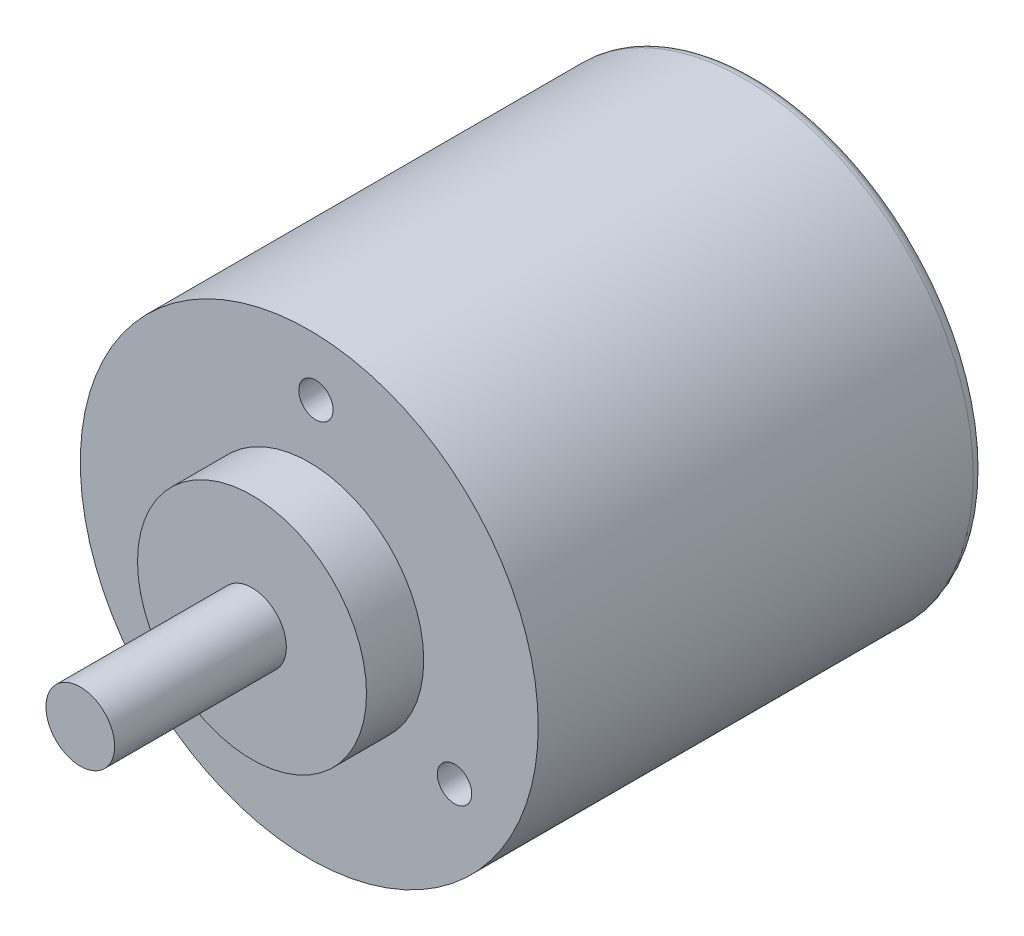
ISO-10303-21;
HEADER;
FILE_DESCRIPTION(('STEP AP214'),'2;1');
FILE_NAME('part.step','',(''),(''),'','','');
FILE_SCHEMA(('AUTOMOTIVE_DESIGN { 1 0 10303 214 1 1 1 1 }'));
ENDSEC;
DATA;
#1=APPLICATION_CONTEXT('core data for automotive mechanical design processes');
#2=APPLICATION_PROTOCOL_DEFINITION('international standard','automotive_design',2000,#1);
#3=PRODUCT_CONTEXT('',#1,'mechanical');
#4=PRODUCT('Part','Part','',(#3));
#5=PRODUCT_RELATED_PRODUCT_CATEGORY('part','',(#4));
#6=PRODUCT_DEFINITION_FORMATION('','',#4);
#7=PRODUCT_DEFINITION_CONTEXT('part definition',#1,'design');
#8=PRODUCT_DEFINITION('design','',#6,#7);
#9=PRODUCT_DEFINITION_SHAPE('','',#8);
#10=(LENGTH_UNIT() NAMED_UNIT(*) SI_UNIT(.MILLI.,.METRE.));
#11=(NAMED_UNIT(*) PLANE_ANGLE_UNIT() SI_UNIT($,.RADIAN.));
#12=(NAMED_UNIT(*) SI_UNIT($,.STERADIAN.) SOLID_ANGLE_UNIT());
#13=UNCERTAINTY_MEASURE_WITH_UNIT(LENGTH_MEASURE(1.E-05),#10,'distance_accuracy_value','');
#14=(GEOMETRIC_REPRESENTATION_CONTEXT(3) GLOBAL_UNCERTAINTY_ASSIGNED_CONTEXT((#13)) GLOBAL_UNIT_ASSIGNED_CONTEXT((#10,
#11,#12)) REPRESENTATION_CONTEXT('',''));
#15=CARTESIAN_POINT('',(0.,0.,0.));
#16=DIRECTION('',(0.,0.,1.));
#17=DIRECTION('',(1.,0.,0.));
#18=AXIS2_PLACEMENT_3D('',#15,#16,#17);
#19=CARTESIAN_POINT('',(0.,0.,39.));
#20=DIRECTION('',(0.,0.,-1.));
#21=DIRECTION('',(-1.,0.,0.));
#22=AXIS2_PLACEMENT_3D('',#19,#20,#21);
#23=CYLINDRICAL_SURFACE('',#22,20.);
#24=CARTESIAN_POINT('',(0.,0.,1.));
#25=DIRECTION('',(0.,0.,1.));
#26=DIRECTION('',(1.,0.,0.));
#27=AXIS2_PLACEMENT_3D('',#24,#25,#26);
#28=CIRCLE('',#27,20.);
#29=CARTESIAN_POINT('',(20.,0.,1.));
#30=VERTEX_POINT('',#29);
#31=EDGE_CURVE('E44',#30,#30,#28,.T.);
#32=ORIENTED_EDGE('',*,*,#31,.T.);
#33=EDGE_LOOP('',(#32));
#34=FACE_BOUND('',#33,.T.);
#35=CARTESIAN_POINT('',(0.,0.,39.));
#36=DIRECTION('',(0.,0.,1.));
#37=DIRECTION('',(1.,0.,0.));
#38=AXIS2_PLACEMENT_3D('',#35,#36,#37);
#39=CIRCLE('',#38,20.);
#40=CARTESIAN_POINT('',(20.,0.,39.));
#41=VERTEX_POINT('',#40);
#42=EDGE_CURVE('E57',#41,#41,#39,.T.);
#43=ORIENTED_EDGE('',*,*,#42,.F.);
#44=EDGE_LOOP('',(#43));
#45=FACE_BOUND('',#44,.T.);
#46=ADVANCED_FACE('F36',(#34,#45),#23,.T.);
#47=CARTESIAN_POINT('',(0.,0.,39.));
#48=DIRECTION('',(0.,0.,1.));
#49=DIRECTION('',(1.,0.,0.));
#50=AXIS2_PLACEMENT_3D('',#47,#48,#49);
#51=PLANE('',#50);
#52=CARTESIAN_POINT('',(-13.2709827552076,-6.99149602810312,39.));
#53=DIRECTION('',(0.,0.,1.));
#54=DIRECTION('',(-0.500000000000004,0.866025403784436,0.));
#55=AXIS2_PLACEMENT_3D('',#52,#53,#54);
#56=CIRCLE('',#55,1.5);
#57=CARTESIAN_POINT('',(-14.0209827552076,-5.69245792242647,39.));
#58=VERTEX_POINT('',#57);
#59=EDGE_CURVE('E89',#58,#58,#56,.T.);
#60=ORIENTED_EDGE('',*,*,#59,.F.);
#61=EDGE_LOOP('',(#60));
#62=FACE_BOUND('',#61,.T.);
#63=CARTESIAN_POINT('',(12.6903045483992,-7.99726018514339,39.));
#64=DIRECTION('',(0.,0.,1.));
#65=DIRECTION('',(-0.499999999999992,-0.866025403784443,0.));
#66=AXIS2_PLACEMENT_3D('',#63,#64,#65);
#67=CIRCLE('',#66,1.5);
#68=CARTESIAN_POINT('',(11.9403045483992,-9.29629829082005,39.));
#69=VERTEX_POINT('',#68);
#70=EDGE_CURVE('E81',#69,#69,#67,.T.);
#71=ORIENTED_EDGE('',*,*,#70,.F.);
#72=EDGE_LOOP('',(#71));
#73=FACE_BOUND('',#72,.T.);
#74=CARTESIAN_POINT('',(0.580678206808581,14.9887562132466,39.));
#75=DIRECTION('',(0.,0.,1.));
#76=DIRECTION('',(1.,0.,0.));
#77=AXIS2_PLACEMENT_3D('',#74,#75,#76);
#78=CIRCLE('',#77,1.5);
#79=CARTESIAN_POINT('',(2.08067820680858,14.9887562132466,39.));
#80=VERTEX_POINT('',#79);
#81=EDGE_CURVE('E73',#80,#80,#78,.T.);
#82=ORIENTED_EDGE('',*,*,#81,.F.);
#83=EDGE_LOOP('',(#82));
#84=FACE_BOUND('',#83,.T.);
#85=CARTESIAN_POINT('',(0.,0.,39.));
#86=DIRECTION('',(0.,0.,1.));
#87=DIRECTION('',(1.,0.,0.));
#88=AXIS2_PLACEMENT_3D('',#85,#86,#87);
#89=CIRCLE('',#88,10.);
#90=CARTESIAN_POINT('',(10.,0.,39.));
#91=VERTEX_POINT('',#90);
#92=EDGE_CURVE('E54',#91,#91,#89,.T.);
#93=ORIENTED_EDGE('',*,*,#92,.F.);
#94=EDGE_LOOP('',(#93));
#95=FACE_BOUND('',#94,.T.);
#96=ORIENTED_EDGE('',*,*,#42,.T.);
#97=EDGE_LOOP('',(#96));
#98=FACE_BOUND('',#97,.T.);
#99=ADVANCED_FACE('F106',(#62,#73,#84,#95,#98),#51,.T.);
#100=CARTESIAN_POINT('',(0.,0.,0.));
#101=DIRECTION('',(0.,0.,1.));
#102=DIRECTION('',(1.,0.,0.));
#103=AXIS2_PLACEMENT_3D('',#100,#101,#102);
#104=PLANE('',#103);
#105=CARTESIAN_POINT('',(0.,0.,0.));
#106=DIRECTION('',(0.,0.,1.));
#107=DIRECTION('',(1.,0.,0.));
#108=AXIS2_PLACEMENT_3D('',#105,#106,#107);
#109=CIRCLE('',#108,19.);
#110=CARTESIAN_POINT('',(19.,0.,0.));
#111=VERTEX_POINT('',#110);
#112=EDGE_CURVE('E10',#111,#111,#109,.F.);
#113=ORIENTED_EDGE('',*,*,#112,.T.);
#114=EDGE_LOOP('',(#113));
#115=FACE_BOUND('',#114,.T.);
#116=ADVANCED_FACE('F109',(#115),#104,.F.);
#117=CARTESIAN_POINT('',(0.,0.,44.));
#118=DIRECTION('',(0.,0.,-1.));
#119=DIRECTION('',(-1.,0.,0.));
#120=AXIS2_PLACEMENT_3D('',#117,#118,#119);
#121=CYLINDRICAL_SURFACE('',#120,10.);
#122=CARTESIAN_POINT('',(0.,0.,44.));
#123=DIRECTION('',(0.,0.,1.));
#124=DIRECTION('',(1.,0.,0.));
#125=AXIS2_PLACEMENT_3D('',#122,#123,#124);
#126=CIRCLE('',#125,10.);
#127=CARTESIAN_POINT('',(10.,0.,44.));
#128=VERTEX_POINT('',#127);
#129=EDGE_CURVE('E61',#128,#128,#126,.T.);
#130=ORIENTED_EDGE('',*,*,#129,.F.);
#131=EDGE_LOOP('',(#130));
#132=FACE_BOUND('',#131,.T.);
#133=ORIENTED_EDGE('',*,*,#92,.T.);
#134=EDGE_LOOP('',(#133));
#135=FACE_BOUND('',#134,.T.);
#136=ADVANCED_FACE('F125',(#132,#135),#121,.T.);
#137=CARTESIAN_POINT('',(0.,0.,44.));
#138=DIRECTION('',(0.,0.,1.));
#139=DIRECTION('',(1.,0.,0.));
#140=AXIS2_PLACEMENT_3D('',#137,#138,#139);
#141=PLANE('',#140);
#142=CARTESIAN_POINT('',(0.,0.,44.));
#143=DIRECTION('',(0.,0.,1.));
#144=DIRECTION('',(1.,0.,0.));
#145=AXIS2_PLACEMENT_3D('',#142,#143,#144);
#146=CIRCLE('',#145,3.);
#147=CARTESIAN_POINT('',(3.,0.,44.));
#148=VERTEX_POINT('',#147);
#149=EDGE_CURVE('E49',#148,#148,#146,.T.);
#150=ORIENTED_EDGE('',*,*,#149,.F.);
#151=EDGE_LOOP('',(#150));
#152=FACE_BOUND('',#151,.T.);
#153=ORIENTED_EDGE('',*,*,#129,.T.);
#154=EDGE_LOOP('',(#153));
#155=FACE_BOUND('',#154,.T.);
#156=ADVANCED_FACE('F129',(#152,#155),#141,.T.);
#157=CARTESIAN_POINT('',(0.,0.,59.));
#158=DIRECTION('',(0.,0.,-1.));
#159=DIRECTION('',(-1.,0.,0.));
#160=AXIS2_PLACEMENT_3D('',#157,#158,#159);
#161=CYLINDRICAL_SURFACE('',#160,3.);
#162=CARTESIAN_POINT('',(0.,0.,59.));
#163=DIRECTION('',(0.,0.,1.));
#164=DIRECTION('',(1.,0.,0.));
#165=AXIS2_PLACEMENT_3D('',#162,#163,#164);
#166=CIRCLE('',#165,3.);
#167=CARTESIAN_POINT('',(3.,0.,59.));
#168=VERTEX_POINT('',#167);
#169=EDGE_CURVE('E67',#168,#168,#166,.T.);
#170=ORIENTED_EDGE('',*,*,#169,.F.);
#171=EDGE_LOOP('',(#170));
#172=FACE_BOUND('',#171,.T.);
#173=ORIENTED_EDGE('',*,*,#149,.T.);
#174=EDGE_LOOP('',(#173));
#175=FACE_BOUND('',#174,.T.);
#176=ADVANCED_FACE('F133',(#172,#175),#161,.T.);
#177=CARTESIAN_POINT('',(0.,0.,59.));
#178=DIRECTION('',(0.,0.,1.));
#179=DIRECTION('',(1.,0.,0.));
#180=AXIS2_PLACEMENT_3D('',#177,#178,#179);
#181=PLANE('',#180);
#182=ORIENTED_EDGE('',*,*,#169,.T.);
#183=EDGE_LOOP('',(#182));
#184=FACE_BOUND('',#183,.T.);
#185=ADVANCED_FACE('F137',(#184),#181,.T.);
#186=CARTESIAN_POINT('',(0.,0.,1.));
#187=DIRECTION('',(0.,0.,1.));
#188=DIRECTION('',(1.,0.,0.));
#189=AXIS2_PLACEMENT_3D('',#186,#187,#188);
#190=TOROIDAL_SURFACE('',#189,19.,1.);
#191=ORIENTED_EDGE('',*,*,#112,.F.);
#192=EDGE_LOOP('',(#191));
#193=FACE_BOUND('',#192,.T.);
#194=ORIENTED_EDGE('',*,*,#31,.F.);
#195=EDGE_LOOP('',(#194));
#196=FACE_BOUND('',#195,.T.);
#197=ADVANCED_FACE('F38',(#193,#196),#190,.T.);
#198=CARTESIAN_POINT('',(0.580678206808581,14.9887562132466,34.));
#199=DIRECTION('',(0.,0.,1.));
#200=DIRECTION('',(1.,0.,0.));
#201=AXIS2_PLACEMENT_3D('',#198,#199,#200);
#202=CYLINDRICAL_SURFACE('',#201,1.5);
#203=CARTESIAN_POINT('',(0.580678206808581,14.9887562132466,34.));
#204=DIRECTION('',(0.,0.,1.));
#205=DIRECTION('',(1.,0.,0.));
#206=AXIS2_PLACEMENT_3D('',#203,#204,#205);
#207=CIRCLE('',#206,1.5);
#208=CARTESIAN_POINT('',(2.08067820680858,14.9887562132466,34.));
#209=VERTEX_POINT('',#208);
#210=EDGE_CURVE('E72',#209,#209,#207,.T.);
#211=ORIENTED_EDGE('',*,*,#210,.F.);
#212=EDGE_LOOP('',(#211));
#213=FACE_BOUND('',#212,.T.);
#214=ORIENTED_EDGE('',*,*,#81,.T.);
#215=EDGE_LOOP('',(#214));
#216=FACE_BOUND('',#215,.T.);
#217=ADVANCED_FACE('F142',(#213,#216),#202,.F.);
#218=CARTESIAN_POINT('',(0.580678206808581,14.9887562132466,34.));
#219=DIRECTION('',(0.,0.,1.));
#220=DIRECTION('',(1.,0.,0.));
#221=AXIS2_PLACEMENT_3D('',#218,#219,#220);
#222=PLANE('',#221);
#223=ORIENTED_EDGE('',*,*,#210,.T.);
#224=EDGE_LOOP('',(#223));
#225=FACE_BOUND('',#224,.T.);
#226=ADVANCED_FACE('F145',(#225),#222,.T.);
#227=CARTESIAN_POINT('',(12.6903045483992,-7.99726018514339,34.));
#228=DIRECTION('',(0.,0.,1.));
#229=DIRECTION('',(1.,0.,0.));
#230=AXIS2_PLACEMENT_3D('',#227,#228,#229);
#231=CYLINDRICAL_SURFACE('',#230,1.5);
#232=CARTESIAN_POINT('',(12.6903045483992,-7.99726018514339,34.));
#233=DIRECTION('',(0.,0.,1.));
#234=DIRECTION('',(-0.499999999999992,-0.866025403784443,0.));
#235=AXIS2_PLACEMENT_3D('',#232,#233,#234);
#236=CIRCLE('',#235,1.5);
#237=CARTESIAN_POINT('',(11.9403045483992,-9.29629829082005,34.));
#238=VERTEX_POINT('',#237);
#239=EDGE_CURVE('E85',#238,#238,#236,.T.);
#240=ORIENTED_EDGE('',*,*,#239,.F.);
#241=EDGE_LOOP('',(#240));
#242=FACE_BOUND('',#241,.T.);
#243=ORIENTED_EDGE('',*,*,#70,.T.);
#244=EDGE_LOOP('',(#243));
#245=FACE_BOUND('',#244,.T.);
#246=ADVANCED_FACE('F149',(#242,#245),#231,.F.);
#247=CARTESIAN_POINT('',(12.6903045483992,-7.99726018514339,34.));
#248=DIRECTION('',(0.,0.,1.));
#249=DIRECTION('',(-0.499999999999992,-0.866025403784443,0.));
#250=AXIS2_PLACEMENT_3D('',#247,#248,#249);
#251=PLANE('',#250);
#252=ORIENTED_EDGE('',*,*,#239,.T.);
#253=EDGE_LOOP('',(#252));
#254=FACE_BOUND('',#253,.T.);
#255=ADVANCED_FACE('F102',(#254),#251,.T.);
#256=CARTESIAN_POINT('',(-13.2709827552076,-6.99149602810312,34.));
#257=DIRECTION('',(0.,0.,1.));
#258=DIRECTION('',(1.,0.,0.));
#259=AXIS2_PLACEMENT_3D('',#256,#257,#258);
#260=CYLINDRICAL_SURFACE('',#259,1.5);
#261=CARTESIAN_POINT('',(-13.2709827552076,-6.99149602810312,34.));
#262=DIRECTION('',(0.,0.,1.));
#263=DIRECTION('',(-0.500000000000004,0.866025403784436,0.));
#264=AXIS2_PLACEMENT_3D('',#261,#262,#263);
#265=CIRCLE('',#264,1.5);
#266=CARTESIAN_POINT('',(-14.0209827552076,-5.69245792242647,34.));
#267=VERTEX_POINT('',#266);
#268=EDGE_CURVE('E77',#267,#267,#265,.T.);
#269=ORIENTED_EDGE('',*,*,#268,.F.);
#270=EDGE_LOOP('',(#269));
#271=FACE_BOUND('',#270,.T.);
#272=ORIENTED_EDGE('',*,*,#59,.T.);
#273=EDGE_LOOP('',(#272));
#274=FACE_BOUND('',#273,.T.);
#275=ADVANCED_FACE('F99',(#271,#274),#260,.F.);
#276=CARTESIAN_POINT('',(-13.2709827552076,-6.99149602810312,34.));
#277=DIRECTION('',(0.,0.,1.));
#278=DIRECTION('',(-0.500000000000004,0.866025403784436,0.));
#279=AXIS2_PLACEMENT_3D('',#276,#277,#278);
#280=PLANE('',#279);
#281=ORIENTED_EDGE('',*,*,#268,.T.);
#282=EDGE_LOOP('',(#281));
#283=FACE_BOUND('',#282,.T.);
#284=ADVANCED_FACE('F97',(#283),#280,.T.);
#285=CLOSED_SHELL('',(#46,#99,#116,#136,#156,#176,#185,#197,#217,#226,#246,#255,#275,#284));
#286=MANIFOLD_SOLID_BREP('B2',#285);
#287=ADVANCED_BREP_SHAPE_REPRESENTATION('',(#18,#286),#14);
#288=SHAPE_DEFINITION_REPRESENTATION(#9,#287);
ENDSEC;
END-ISO-10303-21;
